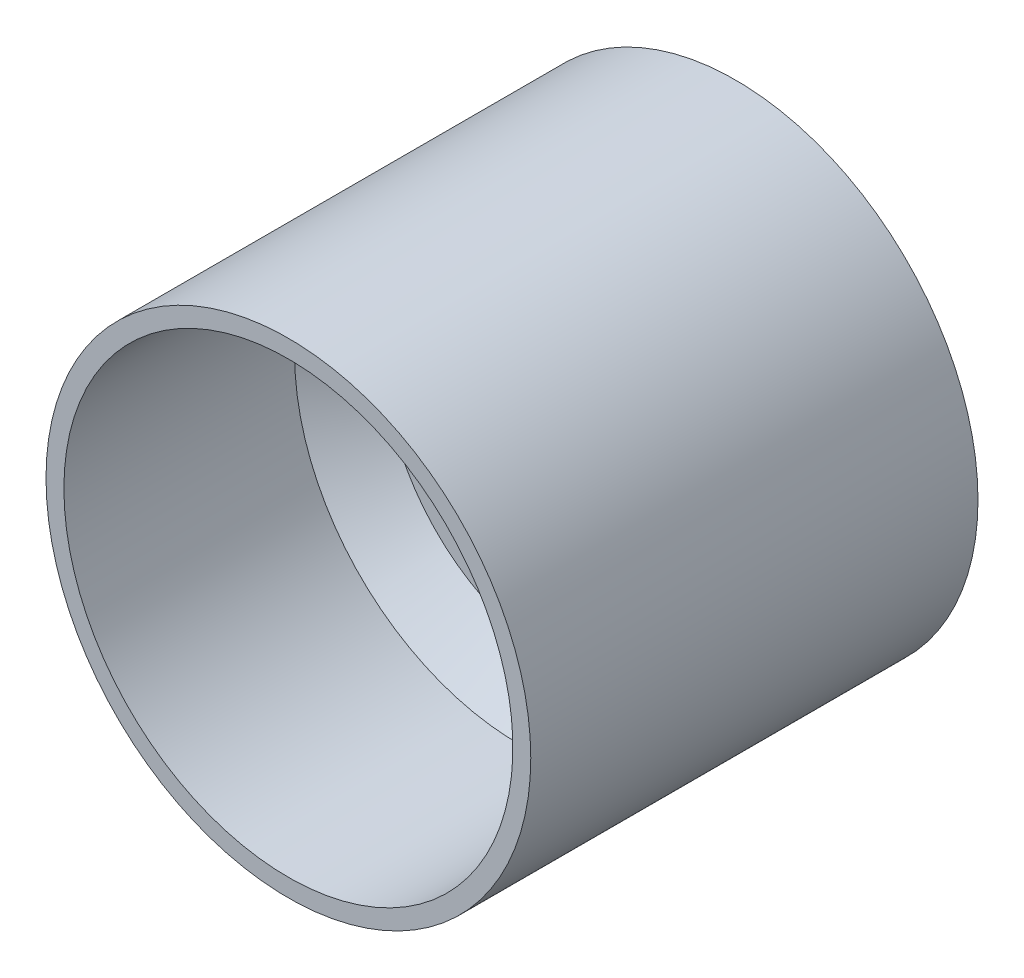
ISO-10303-21;
HEADER;
FILE_DESCRIPTION(('STEP AP214'),'2;1');
FILE_NAME('part.step','',(''),(''),'','','');
FILE_SCHEMA(('AUTOMOTIVE_DESIGN { 1 0 10303 214 1 1 1 1 }'));
ENDSEC;
DATA;
#1=APPLICATION_CONTEXT('core data for automotive mechanical design processes');
#2=APPLICATION_PROTOCOL_DEFINITION('international standard','automotive_design',2000,#1);
#3=PRODUCT_CONTEXT('',#1,'mechanical');
#4=PRODUCT('Part','Part','',(#3));
#5=PRODUCT_RELATED_PRODUCT_CATEGORY('part','',(#4));
#6=PRODUCT_DEFINITION_FORMATION('','',#4);
#7=PRODUCT_DEFINITION_CONTEXT('part definition',#1,'design');
#8=PRODUCT_DEFINITION('design','',#6,#7);
#9=PRODUCT_DEFINITION_SHAPE('','',#8);
#10=(LENGTH_UNIT() NAMED_UNIT(*) SI_UNIT(.MILLI.,.METRE.));
#11=(NAMED_UNIT(*) PLANE_ANGLE_UNIT() SI_UNIT($,.RADIAN.));
#12=(NAMED_UNIT(*) SI_UNIT($,.STERADIAN.) SOLID_ANGLE_UNIT());
#13=UNCERTAINTY_MEASURE_WITH_UNIT(LENGTH_MEASURE(1.E-05),#10,'distance_accuracy_value','');
#14=(GEOMETRIC_REPRESENTATION_CONTEXT(3) GLOBAL_UNCERTAINTY_ASSIGNED_CONTEXT((#13)) GLOBAL_UNIT_ASSIGNED_CONTEXT((#10,
#11,#12)) REPRESENTATION_CONTEXT('',''));
#15=CARTESIAN_POINT('',(0.,0.,0.));
#16=DIRECTION('',(0.,0.,1.));
#17=DIRECTION('',(1.,0.,0.));
#18=AXIS2_PLACEMENT_3D('',#15,#16,#17);
#19=CARTESIAN_POINT('',(25.1,0.,-10.3));
#20=DIRECTION('',(0.,0.,1.));
#21=DIRECTION('',(1.,0.,0.));
#22=AXIS2_PLACEMENT_3D('',#19,#20,#21);
#23=PLANE('',#22);
#24=CARTESIAN_POINT('',(8.5,0.,-10.3));
#25=DIRECTION('',(0.,0.,-1.));
#26=DIRECTION('',(-1.,0.,0.));
#27=AXIS2_PLACEMENT_3D('',#24,#25,#26);
#28=CIRCLE('',#27,1.55);
#29=CARTESIAN_POINT('',(6.95,0.,-10.3));
#30=VERTEX_POINT('',#29);
#31=EDGE_CURVE('E134',#30,#30,#28,.T.);
#32=ORIENTED_EDGE('',*,*,#31,.F.);
#33=EDGE_LOOP('',(#32));
#34=FACE_BOUND('',#33,.T.);
#35=CARTESIAN_POINT('',(0.,-12.5,-10.3));
#36=DIRECTION('',(0.,0.,-1.));
#37=DIRECTION('',(-1.,0.,0.));
#38=AXIS2_PLACEMENT_3D('',#35,#36,#37);
#39=CIRCLE('',#38,1.5);
#40=CARTESIAN_POINT('',(-1.50000000000001,-12.5,-10.3));
#41=VERTEX_POINT('',#40);
#42=EDGE_CURVE('E144',#41,#41,#39,.T.);
#43=ORIENTED_EDGE('',*,*,#42,.F.);
#44=EDGE_LOOP('',(#43));
#45=FACE_BOUND('',#44,.T.);
#46=CARTESIAN_POINT('',(0.,12.5,-10.3));
#47=DIRECTION('',(0.,0.,-1.));
#48=DIRECTION('',(-1.,0.,0.));
#49=AXIS2_PLACEMENT_3D('',#46,#47,#48);
#50=CIRCLE('',#49,1.5);
#51=CARTESIAN_POINT('',(-1.5,12.5,-10.3));
#52=VERTEX_POINT('',#51);
#53=EDGE_CURVE('E140',#52,#52,#50,.T.);
#54=ORIENTED_EDGE('',*,*,#53,.F.);
#55=EDGE_LOOP('',(#54));
#56=FACE_BOUND('',#55,.T.);
#57=CARTESIAN_POINT('',(-8.5,0.,-10.3));
#58=DIRECTION('',(0.,0.,-1.));
#59=DIRECTION('',(-1.,0.,0.));
#60=AXIS2_PLACEMENT_3D('',#57,#58,#59);
#61=CIRCLE('',#60,1.55);
#62=CARTESIAN_POINT('',(-10.05,0.,-10.3));
#63=VERTEX_POINT('',#62);
#64=EDGE_CURVE('E139',#63,#63,#61,.T.);
#65=ORIENTED_EDGE('',*,*,#64,.F.);
#66=EDGE_LOOP('',(#65));
#67=FACE_BOUND('',#66,.T.);
#68=CARTESIAN_POINT('',(0.,0.,-10.3));
#69=DIRECTION('',(0.,0.,1.));
#70=DIRECTION('',(1.,0.,0.));
#71=AXIS2_PLACEMENT_3D('',#68,#69,#70);
#72=CIRCLE('',#71,20.1);
#73=CARTESIAN_POINT('',(20.1,0.,-10.3));
#74=VERTEX_POINT('',#73);
#75=EDGE_CURVE('E55',#74,#74,#72,.F.);
#76=ORIENTED_EDGE('',*,*,#75,.T.);
#77=EDGE_LOOP('',(#76));
#78=FACE_BOUND('',#77,.T.);
#79=CARTESIAN_POINT('',(0.,0.,-10.3));
#80=DIRECTION('',(0.,0.,-1.));
#81=DIRECTION('',(-1.,0.,0.));
#82=AXIS2_PLACEMENT_3D('',#79,#80,#81);
#83=CIRCLE('',#82,5.5);
#84=CARTESIAN_POINT('',(-5.5,0.,-10.3));
#85=VERTEX_POINT('',#84);
#86=EDGE_CURVE('E135',#85,#85,#83,.T.);
#87=ORIENTED_EDGE('',*,*,#86,.F.);
#88=EDGE_LOOP('',(#87));
#89=FACE_BOUND('',#88,.T.);
#90=ADVANCED_FACE('F45',(#34,#45,#56,#67,#78,#89),#23,.F.);
#91=CARTESIAN_POINT('',(0.,0.,-51.2881578947369));
#92=DIRECTION('',(0.,0.,-1.));
#93=DIRECTION('',(-1.,0.,0.));
#94=AXIS2_PLACEMENT_3D('',#91,#92,#93);
#95=CYLINDRICAL_SURFACE('',#94,25.1);
#96=CARTESIAN_POINT('',(0.,0.,-15.3));
#97=DIRECTION('',(0.,0.,1.));
#98=DIRECTION('',(1.,0.,0.));
#99=AXIS2_PLACEMENT_3D('',#96,#97,#98);
#100=CIRCLE('',#99,25.1);
#101=CARTESIAN_POINT('',(25.1,0.,-15.3));
#102=VERTEX_POINT('',#101);
#103=EDGE_CURVE('E10',#102,#102,#100,.T.);
#104=ORIENTED_EDGE('',*,*,#103,.T.);
#105=EDGE_LOOP('',(#104));
#106=FACE_BOUND('',#105,.T.);
#107=CARTESIAN_POINT('',(0.,0.,-23.5));
#108=DIRECTION('',(0.,0.,-1.));
#109=DIRECTION('',(-1.,0.,0.));
#110=AXIS2_PLACEMENT_3D('',#107,#108,#109);
#111=CIRCLE('',#110,25.1);
#112=CARTESIAN_POINT('',(-25.1,0.,-23.5));
#113=VERTEX_POINT('',#112);
#114=EDGE_CURVE('E92',#113,#113,#111,.T.);
#115=ORIENTED_EDGE('',*,*,#114,.T.);
#116=EDGE_LOOP('',(#115));
#117=FACE_BOUND('',#116,.T.);
#118=ADVANCED_FACE('F160',(#106,#117),#95,.F.);
#119=CARTESIAN_POINT('',(0.,0.,-2.3));
#120=DIRECTION('',(0.,0.,-1.));
#121=DIRECTION('',(-1.,0.,0.));
#122=AXIS2_PLACEMENT_3D('',#119,#120,#121);
#123=CIRCLE('',#122,25.1);
#124=CARTESIAN_POINT('',(-25.1,0.,-2.3));
#125=VERTEX_POINT('',#124);
#126=EDGE_CURVE('E60',#125,#125,#123,.T.);
#127=ORIENTED_EDGE('',*,*,#126,.T.);
#128=EDGE_LOOP('',(#127));
#129=FACE_BOUND('',#128,.T.);
#130=CARTESIAN_POINT('',(0.,0.,23.5));
#131=DIRECTION('',(0.,0.,-1.));
#132=DIRECTION('',(-1.,0.,0.));
#133=AXIS2_PLACEMENT_3D('',#130,#131,#132);
#134=CIRCLE('',#133,25.1);
#135=CARTESIAN_POINT('',(-25.1,0.,23.5));
#136=VERTEX_POINT('',#135);
#137=EDGE_CURVE('E96',#136,#136,#134,.T.);
#138=ORIENTED_EDGE('',*,*,#137,.F.);
#139=EDGE_LOOP('',(#138));
#140=FACE_BOUND('',#139,.T.);
#141=ADVANCED_FACE('F207',(#129,#140),#95,.F.);
#142=CARTESIAN_POINT('',(27.1,0.,-26.5));
#143=DIRECTION('',(0.,0.,1.));
#144=DIRECTION('',(1.,0.,0.));
#145=AXIS2_PLACEMENT_3D('',#142,#143,#144);
#146=PLANE('',#145);
#147=CARTESIAN_POINT('',(0.,20.25,-26.5));
#148=DIRECTION('',(0.,0.,-1.));
#149=DIRECTION('',(-1.,0.,0.));
#150=AXIS2_PLACEMENT_3D('',#147,#148,#149);
#151=CIRCLE('',#150,2.);
#152=CARTESIAN_POINT('',(-2.,20.25,-26.5));
#153=VERTEX_POINT('',#152);
#154=EDGE_CURVE('E84',#153,#153,#151,.T.);
#155=ORIENTED_EDGE('',*,*,#154,.F.);
#156=EDGE_LOOP('',(#155));
#157=FACE_BOUND('',#156,.T.);
#158=CARTESIAN_POINT('',(17.5370144266349,-10.125,-26.5));
#159=DIRECTION('',(0.,0.,-1.));
#160=DIRECTION('',(-1.,0.,0.));
#161=AXIS2_PLACEMENT_3D('',#158,#159,#160);
#162=CIRCLE('',#161,2.);
#163=CARTESIAN_POINT('',(15.5370144266349,-10.125,-26.5));
#164=VERTEX_POINT('',#163);
#165=EDGE_CURVE('E111',#164,#164,#162,.T.);
#166=ORIENTED_EDGE('',*,*,#165,.F.);
#167=EDGE_LOOP('',(#166));
#168=FACE_BOUND('',#167,.T.);
#169=CARTESIAN_POINT('',(-17.5370144266349,-10.125,-26.5));
#170=DIRECTION('',(0.,0.,-1.));
#171=DIRECTION('',(-1.,0.,0.));
#172=AXIS2_PLACEMENT_3D('',#169,#170,#171);
#173=CIRCLE('',#172,2.);
#174=CARTESIAN_POINT('',(-19.5370144266349,-10.125,-26.5));
#175=VERTEX_POINT('',#174);
#176=EDGE_CURVE('E107',#175,#175,#173,.T.);
#177=ORIENTED_EDGE('',*,*,#176,.F.);
#178=EDGE_LOOP('',(#177));
#179=FACE_BOUND('',#178,.T.);
#180=CARTESIAN_POINT('',(0.,0.,-26.5));
#181=DIRECTION('',(0.,0.,-1.));
#182=DIRECTION('',(-1.,0.,0.));
#183=AXIS2_PLACEMENT_3D('',#180,#181,#182);
#184=CIRCLE('',#183,15.25);
#185=CARTESIAN_POINT('',(-15.25,0.,-26.5));
#186=VERTEX_POINT('',#185);
#187=EDGE_CURVE('E70',#186,#186,#184,.T.);
#188=ORIENTED_EDGE('',*,*,#187,.F.);
#189=EDGE_LOOP('',(#188));
#190=FACE_BOUND('',#189,.T.);
#191=CARTESIAN_POINT('',(0.,0.,-26.5));
#192=DIRECTION('',(0.,0.,-1.));
#193=DIRECTION('',(-1.,0.,0.));
#194=AXIS2_PLACEMENT_3D('',#191,#192,#193);
#195=CIRCLE('',#194,27.1);
#196=CARTESIAN_POINT('',(-27.1,0.,-26.5));
#197=VERTEX_POINT('',#196);
#198=EDGE_CURVE('E75',#197,#197,#195,.T.);
#199=ORIENTED_EDGE('',*,*,#198,.T.);
#200=EDGE_LOOP('',(#199));
#201=FACE_BOUND('',#200,.T.);
#202=ADVANCED_FACE('F203',(#157,#168,#179,#190,#201),#146,.F.);
#203=CARTESIAN_POINT('',(0.,0.,-51.2881578947369));
#204=DIRECTION('',(0.,0.,-1.));
#205=DIRECTION('',(-1.,0.,0.));
#206=AXIS2_PLACEMENT_3D('',#203,#204,#205);
#207=CYLINDRICAL_SURFACE('',#206,15.25);
#208=CARTESIAN_POINT('',(0.,0.,-23.5));
#209=DIRECTION('',(0.,0.,-1.));
#210=DIRECTION('',(-1.,0.,0.));
#211=AXIS2_PLACEMENT_3D('',#208,#209,#210);
#212=CIRCLE('',#211,15.25);
#213=CARTESIAN_POINT('',(-15.25,0.,-23.5));
#214=VERTEX_POINT('',#213);
#215=EDGE_CURVE('E88',#214,#214,#212,.T.);
#216=ORIENTED_EDGE('',*,*,#215,.F.);
#217=EDGE_LOOP('',(#216));
#218=FACE_BOUND('',#217,.T.);
#219=ORIENTED_EDGE('',*,*,#187,.T.);
#220=EDGE_LOOP('',(#219));
#221=FACE_BOUND('',#220,.T.);
#222=ADVANCED_FACE('F206',(#218,#221),#207,.F.);
#223=CARTESIAN_POINT('',(15.25,0.,-23.5));
#224=DIRECTION('',(0.,0.,-1.));
#225=DIRECTION('',(-1.,0.,0.));
#226=AXIS2_PLACEMENT_3D('',#223,#224,#225);
#227=PLANE('',#226);
#228=CARTESIAN_POINT('',(0.,20.25,-23.5));
#229=DIRECTION('',(0.,0.,-1.));
#230=DIRECTION('',(-1.,0.,0.));
#231=AXIS2_PLACEMENT_3D('',#228,#229,#230);
#232=CIRCLE('',#231,2.);
#233=CARTESIAN_POINT('',(-2.,20.25,-23.5));
#234=VERTEX_POINT('',#233);
#235=EDGE_CURVE('E71',#234,#234,#232,.T.);
#236=ORIENTED_EDGE('',*,*,#235,.T.);
#237=EDGE_LOOP('',(#236));
#238=FACE_BOUND('',#237,.T.);
#239=CARTESIAN_POINT('',(17.5370144266349,-10.125,-23.5));
#240=DIRECTION('',(0.,0.,-1.));
#241=DIRECTION('',(-1.,0.,0.));
#242=AXIS2_PLACEMENT_3D('',#239,#240,#241);
#243=CIRCLE('',#242,2.);
#244=CARTESIAN_POINT('',(15.5370144266349,-10.125,-23.5));
#245=VERTEX_POINT('',#244);
#246=EDGE_CURVE('E76',#245,#245,#243,.T.);
#247=ORIENTED_EDGE('',*,*,#246,.T.);
#248=EDGE_LOOP('',(#247));
#249=FACE_BOUND('',#248,.T.);
#250=CARTESIAN_POINT('',(-17.5370144266349,-10.125,-23.5));
#251=DIRECTION('',(0.,0.,-1.));
#252=DIRECTION('',(-1.,0.,0.));
#253=AXIS2_PLACEMENT_3D('',#250,#251,#252);
#254=CIRCLE('',#253,2.);
#255=CARTESIAN_POINT('',(-19.5370144266349,-10.125,-23.5));
#256=VERTEX_POINT('',#255);
#257=EDGE_CURVE('E80',#256,#256,#254,.T.);
#258=ORIENTED_EDGE('',*,*,#257,.T.);
#259=EDGE_LOOP('',(#258));
#260=FACE_BOUND('',#259,.T.);
#261=ORIENTED_EDGE('',*,*,#114,.F.);
#262=EDGE_LOOP('',(#261));
#263=FACE_BOUND('',#262,.T.);
#264=ORIENTED_EDGE('',*,*,#215,.T.);
#265=EDGE_LOOP('',(#264));
#266=FACE_BOUND('',#265,.T.);
#267=ADVANCED_FACE('F211',(#238,#249,#260,#263,#266),#227,.F.);
#268=CARTESIAN_POINT('',(25.1,0.,23.5));
#269=DIRECTION('',(0.,0.,-1.));
#270=DIRECTION('',(-1.,0.,0.));
#271=AXIS2_PLACEMENT_3D('',#268,#269,#270);
#272=PLANE('',#271);
#273=CARTESIAN_POINT('',(0.,0.,23.5));
#274=DIRECTION('',(0.,0.,-1.));
#275=DIRECTION('',(-1.,0.,0.));
#276=AXIS2_PLACEMENT_3D('',#273,#274,#275);
#277=CIRCLE('',#276,27.1);
#278=CARTESIAN_POINT('',(-27.1,0.,23.5));
#279=VERTEX_POINT('',#278);
#280=EDGE_CURVE('E100',#279,#279,#277,.T.);
#281=ORIENTED_EDGE('',*,*,#280,.F.);
#282=EDGE_LOOP('',(#281));
#283=FACE_BOUND('',#282,.T.);
#284=ORIENTED_EDGE('',*,*,#137,.T.);
#285=EDGE_LOOP('',(#284));
#286=FACE_BOUND('',#285,.T.);
#287=ADVANCED_FACE('F215',(#283,#286),#272,.F.);
#288=CARTESIAN_POINT('',(0.,0.,-51.2881578947369));
#289=DIRECTION('',(0.,0.,-1.));
#290=DIRECTION('',(-1.,0.,0.));
#291=AXIS2_PLACEMENT_3D('',#288,#289,#290);
#292=CYLINDRICAL_SURFACE('',#291,27.1);
#293=ORIENTED_EDGE('',*,*,#198,.F.);
#294=EDGE_LOOP('',(#293));
#295=FACE_BOUND('',#294,.T.);
#296=ORIENTED_EDGE('',*,*,#280,.T.);
#297=EDGE_LOOP('',(#296));
#298=FACE_BOUND('',#297,.T.);
#299=ADVANCED_FACE('F221',(#295,#298),#292,.T.);
#300=CARTESIAN_POINT('',(-17.5370144266349,-10.125,-16.5));
#301=DIRECTION('',(0.,0.,-1.));
#302=DIRECTION('',(-1.,0.,0.));
#303=AXIS2_PLACEMENT_3D('',#300,#301,#302);
#304=CYLINDRICAL_SURFACE('',#303,2.);
#305=ORIENTED_EDGE('',*,*,#176,.T.);
#306=EDGE_LOOP('',(#305));
#307=FACE_BOUND('',#306,.T.);
#308=ORIENTED_EDGE('',*,*,#257,.F.);
#309=EDGE_LOOP('',(#308));
#310=FACE_BOUND('',#309,.T.);
#311=ADVANCED_FACE('F225',(#307,#310),#304,.F.);
#312=CARTESIAN_POINT('',(17.5370144266349,-10.125,-16.5));
#313=DIRECTION('',(0.,0.,-1.));
#314=DIRECTION('',(-1.,0.,0.));
#315=AXIS2_PLACEMENT_3D('',#312,#313,#314);
#316=CYLINDRICAL_SURFACE('',#315,2.);
#317=ORIENTED_EDGE('',*,*,#165,.T.);
#318=EDGE_LOOP('',(#317));
#319=FACE_BOUND('',#318,.T.);
#320=ORIENTED_EDGE('',*,*,#246,.F.);
#321=EDGE_LOOP('',(#320));
#322=FACE_BOUND('',#321,.T.);
#323=ADVANCED_FACE('F229',(#319,#322),#316,.F.);
#324=CARTESIAN_POINT('',(0.,20.25,-16.5));
#325=DIRECTION('',(0.,0.,-1.));
#326=DIRECTION('',(-1.,0.,0.));
#327=AXIS2_PLACEMENT_3D('',#324,#325,#326);
#328=CYLINDRICAL_SURFACE('',#327,2.);
#329=ORIENTED_EDGE('',*,*,#154,.T.);
#330=EDGE_LOOP('',(#329));
#331=FACE_BOUND('',#330,.T.);
#332=ORIENTED_EDGE('',*,*,#235,.F.);
#333=EDGE_LOOP('',(#332));
#334=FACE_BOUND('',#333,.T.);
#335=ADVANCED_FACE('F184',(#331,#334),#328,.F.);
#336=CARTESIAN_POINT('',(0.,0.,-7.3));
#337=DIRECTION('',(0.,0.,-1.));
#338=DIRECTION('',(-1.,0.,0.));
#339=AXIS2_PLACEMENT_3D('',#336,#337,#338);
#340=PLANE('',#339);
#341=CARTESIAN_POINT('',(8.5,0.,-7.3));
#342=DIRECTION('',(0.,0.,-1.));
#343=DIRECTION('',(-1.,0.,0.));
#344=AXIS2_PLACEMENT_3D('',#341,#342,#343);
#345=CIRCLE('',#344,1.55);
#346=CARTESIAN_POINT('',(6.95,0.,-7.3));
#347=VERTEX_POINT('',#346);
#348=EDGE_CURVE('E118',#347,#347,#345,.T.);
#349=ORIENTED_EDGE('',*,*,#348,.T.);
#350=EDGE_LOOP('',(#349));
#351=FACE_BOUND('',#350,.T.);
#352=CARTESIAN_POINT('',(0.,-12.5,-7.3));
#353=DIRECTION('',(0.,0.,-1.));
#354=DIRECTION('',(-1.,0.,0.));
#355=AXIS2_PLACEMENT_3D('',#352,#353,#354);
#356=CIRCLE('',#355,1.5);
#357=CARTESIAN_POINT('',(-1.50000000000001,-12.5,-7.3));
#358=VERTEX_POINT('',#357);
#359=EDGE_CURVE('E122',#358,#358,#356,.T.);
#360=ORIENTED_EDGE('',*,*,#359,.T.);
#361=EDGE_LOOP('',(#360));
#362=FACE_BOUND('',#361,.T.);
#363=CARTESIAN_POINT('',(0.,12.5,-7.3));
#364=DIRECTION('',(0.,0.,-1.));
#365=DIRECTION('',(-1.,0.,0.));
#366=AXIS2_PLACEMENT_3D('',#363,#364,#365);
#367=CIRCLE('',#366,1.5);
#368=CARTESIAN_POINT('',(-1.5,12.5,-7.3));
#369=VERTEX_POINT('',#368);
#370=EDGE_CURVE('E126',#369,#369,#367,.T.);
#371=ORIENTED_EDGE('',*,*,#370,.T.);
#372=EDGE_LOOP('',(#371));
#373=FACE_BOUND('',#372,.T.);
#374=CARTESIAN_POINT('',(0.,0.,-7.3));
#375=DIRECTION('',(0.,0.,-1.));
#376=DIRECTION('',(-1.,0.,0.));
#377=AXIS2_PLACEMENT_3D('',#374,#375,#376);
#378=CIRCLE('',#377,5.5);
#379=CARTESIAN_POINT('',(-5.5,0.,-7.3));
#380=VERTEX_POINT('',#379);
#381=EDGE_CURVE('E50',#380,#380,#378,.T.);
#382=ORIENTED_EDGE('',*,*,#381,.T.);
#383=EDGE_LOOP('',(#382));
#384=FACE_BOUND('',#383,.T.);
#385=CARTESIAN_POINT('',(-8.5,0.,-7.3));
#386=DIRECTION('',(0.,0.,-1.));
#387=DIRECTION('',(-1.,0.,0.));
#388=AXIS2_PLACEMENT_3D('',#385,#386,#387);
#389=CIRCLE('',#388,1.55);
#390=CARTESIAN_POINT('',(-10.05,0.,-7.3));
#391=VERTEX_POINT('',#390);
#392=EDGE_CURVE('E130',#391,#391,#389,.T.);
#393=ORIENTED_EDGE('',*,*,#392,.T.);
#394=EDGE_LOOP('',(#393));
#395=FACE_BOUND('',#394,.T.);
#396=CARTESIAN_POINT('',(0.,0.,-7.3));
#397=DIRECTION('',(0.,0.,-1.));
#398=DIRECTION('',(-1.,0.,0.));
#399=AXIS2_PLACEMENT_3D('',#396,#397,#398);
#400=CIRCLE('',#399,20.1);
#401=CARTESIAN_POINT('',(-20.1,0.,-7.3));
#402=VERTEX_POINT('',#401);
#403=EDGE_CURVE('E66',#402,#402,#400,.F.);
#404=ORIENTED_EDGE('',*,*,#403,.T.);
#405=EDGE_LOOP('',(#404));
#406=FACE_BOUND('',#405,.T.);
#407=ADVANCED_FACE('F180',(#351,#362,#373,#384,#395,#406),#340,.F.);
#408=CARTESIAN_POINT('',(0.,0.,-7.3));
#409=DIRECTION('',(0.,0.,1.));
#410=DIRECTION('',(1.,0.,0.));
#411=AXIS2_PLACEMENT_3D('',#408,#409,#410);
#412=CONICAL_SURFACE('',#411,20.1,0.785398163397453);
#413=ORIENTED_EDGE('',*,*,#126,.F.);
#414=EDGE_LOOP('',(#413));
#415=FACE_BOUND('',#414,.T.);
#416=ORIENTED_EDGE('',*,*,#403,.F.);
#417=EDGE_LOOP('',(#416));
#418=FACE_BOUND('',#417,.T.);
#419=ADVANCED_FACE('F183',(#415,#418),#412,.F.);
#420=CARTESIAN_POINT('',(0.,0.,-10.3));
#421=DIRECTION('',(0.,0.,-1.));
#422=DIRECTION('',(-1.,0.,0.));
#423=AXIS2_PLACEMENT_3D('',#420,#421,#422);
#424=CONICAL_SURFACE('',#423,20.1,0.785398163397454);
#425=ORIENTED_EDGE('',*,*,#103,.F.);
#426=EDGE_LOOP('',(#425));
#427=FACE_BOUND('',#426,.T.);
#428=ORIENTED_EDGE('',*,*,#75,.F.);
#429=EDGE_LOOP('',(#428));
#430=FACE_BOUND('',#429,.T.);
#431=ADVANCED_FACE('F48',(#427,#430),#424,.F.);
#432=CARTESIAN_POINT('',(-8.5,0.,-0.300000000000002));
#433=DIRECTION('',(0.,0.,-1.));
#434=DIRECTION('',(-1.,0.,0.));
#435=AXIS2_PLACEMENT_3D('',#432,#433,#434);
#436=CYLINDRICAL_SURFACE('',#435,1.55);
#437=ORIENTED_EDGE('',*,*,#64,.T.);
#438=EDGE_LOOP('',(#437));
#439=FACE_BOUND('',#438,.T.);
#440=ORIENTED_EDGE('',*,*,#392,.F.);
#441=EDGE_LOOP('',(#440));
#442=FACE_BOUND('',#441,.T.);
#443=ADVANCED_FACE('F196',(#439,#442),#436,.F.);
#444=CARTESIAN_POINT('',(0.,12.5,-0.300000000000002));
#445=DIRECTION('',(0.,0.,-1.));
#446=DIRECTION('',(-1.,0.,0.));
#447=AXIS2_PLACEMENT_3D('',#444,#445,#446);
#448=CYLINDRICAL_SURFACE('',#447,1.5);
#449=ORIENTED_EDGE('',*,*,#53,.T.);
#450=EDGE_LOOP('',(#449));
#451=FACE_BOUND('',#450,.T.);
#452=ORIENTED_EDGE('',*,*,#370,.F.);
#453=EDGE_LOOP('',(#452));
#454=FACE_BOUND('',#453,.T.);
#455=ADVANCED_FACE('F239',(#451,#454),#448,.F.);
#456=CARTESIAN_POINT('',(0.,-12.5,-0.300000000000002));
#457=DIRECTION('',(0.,0.,-1.));
#458=DIRECTION('',(-1.,0.,0.));
#459=AXIS2_PLACEMENT_3D('',#456,#457,#458);
#460=CYLINDRICAL_SURFACE('',#459,1.5);
#461=ORIENTED_EDGE('',*,*,#42,.T.);
#462=EDGE_LOOP('',(#461));
#463=FACE_BOUND('',#462,.T.);
#464=ORIENTED_EDGE('',*,*,#359,.F.);
#465=EDGE_LOOP('',(#464));
#466=FACE_BOUND('',#465,.T.);
#467=ADVANCED_FACE('F241',(#463,#466),#460,.F.);
#468=CARTESIAN_POINT('',(8.5,0.,-0.300000000000002));
#469=DIRECTION('',(0.,0.,-1.));
#470=DIRECTION('',(-1.,0.,0.));
#471=AXIS2_PLACEMENT_3D('',#468,#469,#470);
#472=CYLINDRICAL_SURFACE('',#471,1.55);
#473=ORIENTED_EDGE('',*,*,#31,.T.);
#474=EDGE_LOOP('',(#473));
#475=FACE_BOUND('',#474,.T.);
#476=ORIENTED_EDGE('',*,*,#348,.F.);
#477=EDGE_LOOP('',(#476));
#478=FACE_BOUND('',#477,.T.);
#479=ADVANCED_FACE('F155',(#475,#478),#472,.F.);
#480=CARTESIAN_POINT('',(0.,0.,-0.300000000000002));
#481=DIRECTION('',(0.,0.,-1.));
#482=DIRECTION('',(-1.,0.,0.));
#483=AXIS2_PLACEMENT_3D('',#480,#481,#482);
#484=CYLINDRICAL_SURFACE('',#483,5.5);
#485=ORIENTED_EDGE('',*,*,#86,.T.);
#486=EDGE_LOOP('',(#485));
#487=FACE_BOUND('',#486,.T.);
#488=ORIENTED_EDGE('',*,*,#381,.F.);
#489=EDGE_LOOP('',(#488));
#490=FACE_BOUND('',#489,.T.);
#491=ADVANCED_FACE('F172',(#487,#490),#484,.F.);
#492=CLOSED_SHELL('',(#90,#118,#141,#202,#222,#267,#287,#299,#311,#323,#335,#407,#419,#431,#443,
#455,#467,#479,#491));
#493=MANIFOLD_SOLID_BREP('B2',#492);
#494=ADVANCED_BREP_SHAPE_REPRESENTATION('',(#18,#493),#14);
#495=SHAPE_DEFINITION_REPRESENTATION(#9,#494);
ENDSEC;
END-ISO-10303-21;
